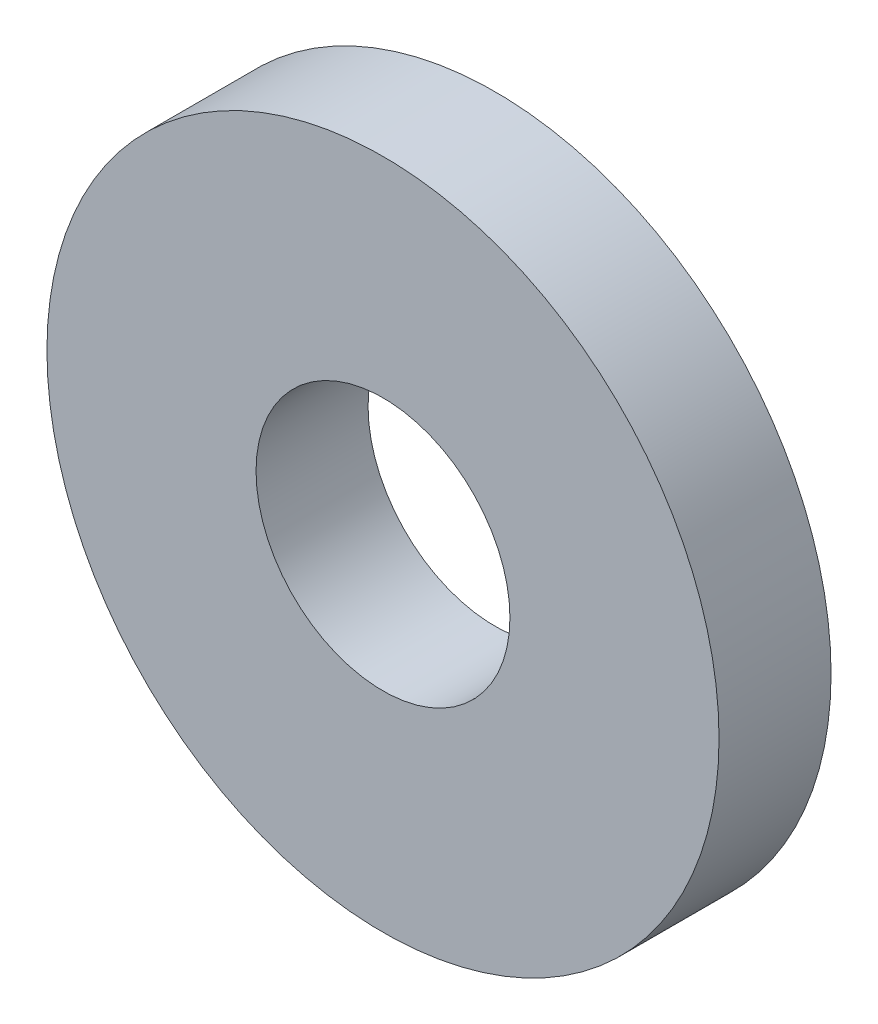
ISO-10303-21;
HEADER;
FILE_DESCRIPTION(('STEP AP214'),'2;1');
FILE_NAME('part.step','',(''),(''),'','','');
FILE_SCHEMA(('AUTOMOTIVE_DESIGN { 1 0 10303 214 1 1 1 1 }'));
ENDSEC;
DATA;
#1=APPLICATION_CONTEXT('core data for automotive mechanical design processes');
#2=APPLICATION_PROTOCOL_DEFINITION('international standard','automotive_design',2000,#1);
#3=PRODUCT_CONTEXT('',#1,'mechanical');
#4=PRODUCT('Part','Part','',(#3));
#5=PRODUCT_RELATED_PRODUCT_CATEGORY('part','',(#4));
#6=PRODUCT_DEFINITION_FORMATION('','',#4);
#7=PRODUCT_DEFINITION_CONTEXT('part definition',#1,'design');
#8=PRODUCT_DEFINITION('design','',#6,#7);
#9=PRODUCT_DEFINITION_SHAPE('','',#8);
#10=(LENGTH_UNIT() NAMED_UNIT(*) SI_UNIT(.MILLI.,.METRE.));
#11=(NAMED_UNIT(*) PLANE_ANGLE_UNIT() SI_UNIT($,.RADIAN.));
#12=(NAMED_UNIT(*) SI_UNIT($,.STERADIAN.) SOLID_ANGLE_UNIT());
#13=UNCERTAINTY_MEASURE_WITH_UNIT(LENGTH_MEASURE(1.E-05),#10,'distance_accuracy_value','');
#14=(GEOMETRIC_REPRESENTATION_CONTEXT(3) GLOBAL_UNCERTAINTY_ASSIGNED_CONTEXT((#13)) GLOBAL_UNIT_ASSIGNED_CONTEXT((#10,
#11,#12)) REPRESENTATION_CONTEXT('',''));
#15=CARTESIAN_POINT('',(0.,0.,0.));
#16=DIRECTION('',(0.,0.,1.));
#17=DIRECTION('',(1.,0.,0.));
#18=AXIS2_PLACEMENT_3D('',#15,#16,#17);
#19=CARTESIAN_POINT('',(0.,0.,-15.));
#20=DIRECTION('',(0.,0.,1.));
#21=DIRECTION('',(1.,0.,0.));
#22=AXIS2_PLACEMENT_3D('',#19,#20,#21);
#23=CYLINDRICAL_SURFACE('',#22,45.);
#24=CARTESIAN_POINT('',(0.,0.,-15.));
#25=DIRECTION('',(0.,0.,1.));
#26=DIRECTION('',(1.,0.,0.));
#27=AXIS2_PLACEMENT_3D('',#24,#25,#26);
#28=CIRCLE('',#27,45.);
#29=CARTESIAN_POINT('',(45.,0.,-15.));
#30=VERTEX_POINT('',#29);
#31=EDGE_CURVE('E10',#30,#30,#28,.T.);
#32=ORIENTED_EDGE('',*,*,#31,.T.);
#33=EDGE_LOOP('',(#32));
#34=FACE_BOUND('',#33,.T.);
#35=CARTESIAN_POINT('',(0.,0.,0.));
#36=DIRECTION('',(0.,0.,1.));
#37=DIRECTION('',(1.,0.,0.));
#38=AXIS2_PLACEMENT_3D('',#35,#36,#37);
#39=CIRCLE('',#38,45.);
#40=CARTESIAN_POINT('',(45.,0.,0.));
#41=VERTEX_POINT('',#40);
#42=EDGE_CURVE('E36',#41,#41,#39,.T.);
#43=ORIENTED_EDGE('',*,*,#42,.F.);
#44=EDGE_LOOP('',(#43));
#45=FACE_BOUND('',#44,.T.);
#46=ADVANCED_FACE('F33',(#34,#45),#23,.T.);
#47=CARTESIAN_POINT('',(0.,0.,-15.));
#48=DIRECTION('',(0.,0.,1.));
#49=DIRECTION('',(1.,0.,0.));
#50=AXIS2_PLACEMENT_3D('',#47,#48,#49);
#51=PLANE('',#50);
#52=CARTESIAN_POINT('',(0.,0.,-15.));
#53=DIRECTION('',(0.,0.,1.));
#54=DIRECTION('',(1.,0.,0.));
#55=AXIS2_PLACEMENT_3D('',#52,#53,#54);
#56=CIRCLE('',#55,17.);
#57=CARTESIAN_POINT('',(17.,0.,-15.));
#58=VERTEX_POINT('',#57);
#59=EDGE_CURVE('E43',#58,#58,#56,.T.);
#60=ORIENTED_EDGE('',*,*,#59,.T.);
#61=EDGE_LOOP('',(#60));
#62=FACE_BOUND('',#61,.T.);
#63=ORIENTED_EDGE('',*,*,#31,.F.);
#64=EDGE_LOOP('',(#63));
#65=FACE_BOUND('',#64,.T.);
#66=ADVANCED_FACE('F51',(#62,#65),#51,.F.);
#67=CARTESIAN_POINT('',(0.,0.,0.));
#68=DIRECTION('',(0.,0.,1.));
#69=DIRECTION('',(1.,0.,0.));
#70=AXIS2_PLACEMENT_3D('',#67,#68,#69);
#71=PLANE('',#70);
#72=CARTESIAN_POINT('',(0.,0.,0.));
#73=DIRECTION('',(0.,0.,1.));
#74=DIRECTION('',(1.,0.,0.));
#75=AXIS2_PLACEMENT_3D('',#72,#73,#74);
#76=CIRCLE('',#75,17.);
#77=CARTESIAN_POINT('',(17.,0.,0.));
#78=VERTEX_POINT('',#77);
#79=EDGE_CURVE('E45',#78,#78,#76,.T.);
#80=ORIENTED_EDGE('',*,*,#79,.F.);
#81=EDGE_LOOP('',(#80));
#82=FACE_BOUND('',#81,.T.);
#83=ORIENTED_EDGE('',*,*,#42,.T.);
#84=EDGE_LOOP('',(#83));
#85=FACE_BOUND('',#84,.T.);
#86=ADVANCED_FACE('F57',(#82,#85),#71,.T.);
#87=CARTESIAN_POINT('',(0.,0.,-15.));
#88=DIRECTION('',(0.,0.,1.));
#89=DIRECTION('',(1.,0.,0.));
#90=AXIS2_PLACEMENT_3D('',#87,#88,#89);
#91=CYLINDRICAL_SURFACE('',#90,17.);
#92=ORIENTED_EDGE('',*,*,#59,.F.);
#93=EDGE_LOOP('',(#92));
#94=FACE_BOUND('',#93,.T.);
#95=ORIENTED_EDGE('',*,*,#79,.T.);
#96=EDGE_LOOP('',(#95));
#97=FACE_BOUND('',#96,.T.);
#98=ADVANCED_FACE('F54',(#94,#97),#91,.F.);
#99=CLOSED_SHELL('',(#46,#66,#86,#98));
#100=MANIFOLD_SOLID_BREP('B2',#99);
#101=ADVANCED_BREP_SHAPE_REPRESENTATION('',(#18,#100),#14);
#102=SHAPE_DEFINITION_REPRESENTATION(#9,#101);
ENDSEC;
END-ISO-10303-21;
